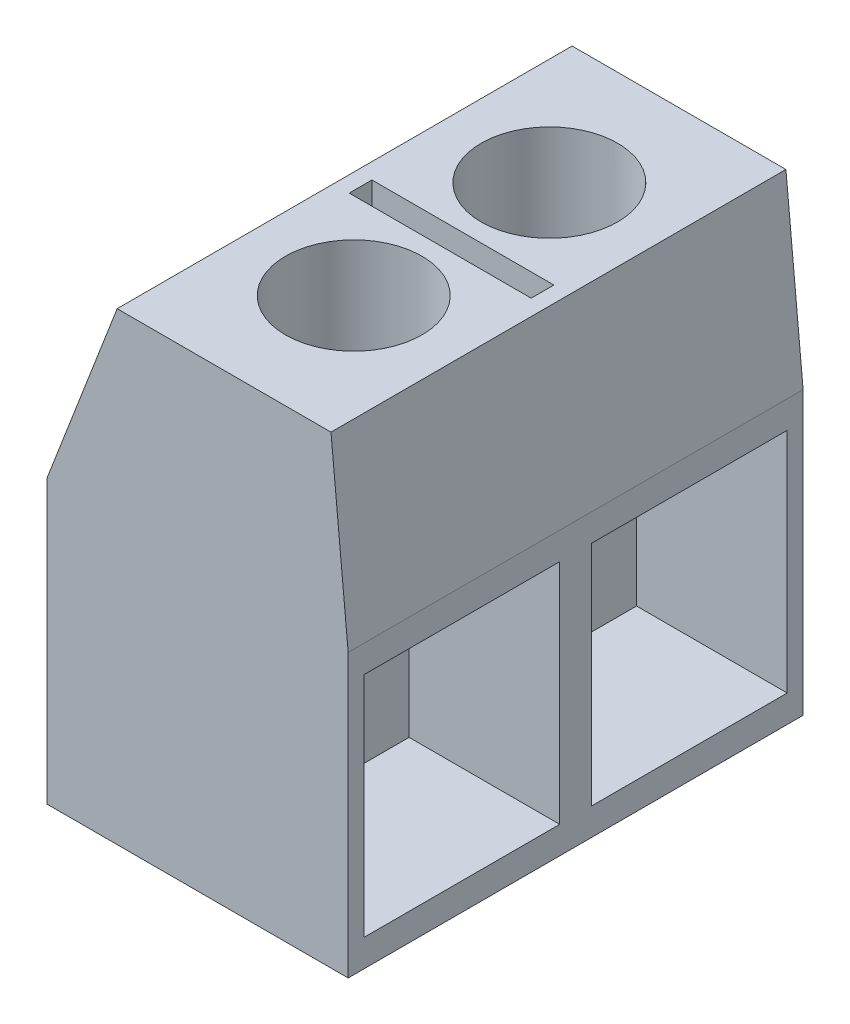
ISO-10303-21;
HEADER;
FILE_DESCRIPTION(('STEP AP214'),'2;1');
FILE_NAME('part.step','',(''),(''),'','','');
FILE_SCHEMA(('AUTOMOTIVE_DESIGN { 1 0 10303 214 1 1 1 1 }'));
ENDSEC;
DATA;
#1=APPLICATION_CONTEXT('core data for automotive mechanical design processes');
#2=APPLICATION_PROTOCOL_DEFINITION('international standard','automotive_design',2000,#1);
#3=PRODUCT_CONTEXT('',#1,'mechanical');
#4=PRODUCT('Part','Part','',(#3));
#5=PRODUCT_RELATED_PRODUCT_CATEGORY('part','',(#4));
#6=PRODUCT_DEFINITION_FORMATION('','',#4);
#7=PRODUCT_DEFINITION_CONTEXT('part definition',#1,'design');
#8=PRODUCT_DEFINITION('design','',#6,#7);
#9=PRODUCT_DEFINITION_SHAPE('','',#8);
#10=(LENGTH_UNIT() NAMED_UNIT(*) SI_UNIT(.MILLI.,.METRE.));
#11=(NAMED_UNIT(*) PLANE_ANGLE_UNIT() SI_UNIT($,.RADIAN.));
#12=(NAMED_UNIT(*) SI_UNIT($,.STERADIAN.) SOLID_ANGLE_UNIT());
#13=UNCERTAINTY_MEASURE_WITH_UNIT(LENGTH_MEASURE(1.E-05),#10,'distance_accuracy_value','');
#14=(GEOMETRIC_REPRESENTATION_CONTEXT(3) GLOBAL_UNCERTAINTY_ASSIGNED_CONTEXT((#13)) GLOBAL_UNIT_ASSIGNED_CONTEXT((#10,
#11,#12)) REPRESENTATION_CONTEXT('',''));
#15=CARTESIAN_POINT('',(0.,0.,0.));
#16=DIRECTION('',(0.,0.,1.));
#17=DIRECTION('',(1.,0.,0.));
#18=AXIS2_PLACEMENT_3D('',#15,#16,#17);
#19=CARTESIAN_POINT('',(2.93362658769155,10.2022383612236,10.));
#20=DIRECTION('',(0.,-1.,0.));
#21=DIRECTION('',(0.,0.,-1.));
#22=AXIS2_PLACEMENT_3D('',#19,#20,#21);
#23=PLANE('',#22);
#24=DIRECTION('',(0.,0.,-1.));
#25=VECTOR('',#24,1.);
#26=CARTESIAN_POINT('',(2.58362658769155,10.2022383612236,0.));
#27=LINE('',#26,#25);
#28=CARTESIAN_POINT('',(2.58362658769155,10.2022383612236,5.25));
#29=VERTEX_POINT('',#28);
#30=CARTESIAN_POINT('',(2.58362658769155,10.2022383612236,4.75));
#31=VERTEX_POINT('',#30);
#32=EDGE_CURVE('E227',#29,#31,#27,.T.);
#33=ORIENTED_EDGE('',*,*,#32,.F.);
#34=DIRECTION('',(1.,0.,0.));
#35=VECTOR('',#34,1.);
#36=CARTESIAN_POINT('',(0.,10.2022383612236,5.25));
#37=LINE('',#36,#35);
#38=CARTESIAN_POINT('',(-1.41637341230845,10.2022383612236,5.25));
#39=VERTEX_POINT('',#38);
#40=EDGE_CURVE('E55',#39,#29,#37,.T.);
#41=ORIENTED_EDGE('',*,*,#40,.F.);
#42=DIRECTION('',(0.,0.,-1.));
#43=VECTOR('',#42,1.);
#44=CARTESIAN_POINT('',(-1.41637341230845,10.2022383612236,0.));
#45=LINE('',#44,#43);
#46=CARTESIAN_POINT('',(-1.41637341230845,10.2022383612236,4.75));
#47=VERTEX_POINT('',#46);
#48=EDGE_CURVE('E211',#39,#47,#45,.T.);
#49=ORIENTED_EDGE('',*,*,#48,.T.);
#50=DIRECTION('',(1.,0.,0.));
#51=VECTOR('',#50,1.);
#52=CARTESIAN_POINT('',(0.,10.2022383612236,4.75));
#53=LINE('',#52,#51);
#54=EDGE_CURVE('E215',#47,#31,#53,.T.);
#55=ORIENTED_EDGE('',*,*,#54,.T.);
#56=EDGE_LOOP('',(#33,#41,#49,#55));
#57=FACE_BOUND('',#56,.T.);
#58=CARTESIAN_POINT('',(0.583626587691551,10.2022383612236,2.85));
#59=DIRECTION('',(0.,1.,0.));
#60=DIRECTION('',(0.,0.,1.));
#61=AXIS2_PLACEMENT_3D('',#58,#59,#60);
#62=CIRCLE('',#61,1.5);
#63=CARTESIAN_POINT('',(0.583626587691551,10.2022383612236,4.35));
#64=VERTEX_POINT('',#63);
#65=EDGE_CURVE('E244',#64,#64,#62,.T.);
#66=ORIENTED_EDGE('',*,*,#65,.F.);
#67=EDGE_LOOP('',(#66));
#68=FACE_BOUND('',#67,.T.);
#69=DIRECTION('',(-1.,0.,0.));
#70=VECTOR('',#69,1.);
#71=CARTESIAN_POINT('',(2.93362658769155,10.2022383612236,0.));
#72=LINE('',#71,#70);
#73=CARTESIAN_POINT('',(2.93362658769155,10.2022383612236,0.));
#74=VERTEX_POINT('',#73);
#75=CARTESIAN_POINT('',(-1.76637341230845,10.2022383612236,0.));
#76=VERTEX_POINT('',#75);
#77=EDGE_CURVE('E343',#74,#76,#72,.T.);
#78=ORIENTED_EDGE('',*,*,#77,.T.);
#79=DIRECTION('',(0.,0.,-1.));
#80=VECTOR('',#79,1.);
#81=CARTESIAN_POINT('',(-1.76637341230845,10.2022383612236,10.));
#82=LINE('',#81,#80);
#83=CARTESIAN_POINT('',(-1.76637341230845,10.2022383612236,10.));
#84=VERTEX_POINT('',#83);
#85=EDGE_CURVE('E365',#84,#76,#82,.T.);
#86=ORIENTED_EDGE('',*,*,#85,.F.);
#87=DIRECTION('',(-1.,0.,0.));
#88=VECTOR('',#87,1.);
#89=CARTESIAN_POINT('',(2.93362658769155,10.2022383612236,10.));
#90=LINE('',#89,#88);
#91=CARTESIAN_POINT('',(2.93362658769155,10.2022383612236,10.));
#92=VERTEX_POINT('',#91);
#93=EDGE_CURVE('E324',#92,#84,#90,.T.);
#94=ORIENTED_EDGE('',*,*,#93,.F.);
#95=DIRECTION('',(0.,0.,-1.));
#96=VECTOR('',#95,1.);
#97=CARTESIAN_POINT('',(2.93362658769155,10.2022383612236,10.));
#98=LINE('',#97,#96);
#99=EDGE_CURVE('E369',#92,#74,#98,.T.);
#100=ORIENTED_EDGE('',*,*,#99,.T.);
#101=EDGE_LOOP('',(#78,#86,#94,#100));
#102=FACE_BOUND('',#101,.T.);
#103=CARTESIAN_POINT('',(0.583626587691551,10.2022383612236,7.15));
#104=DIRECTION('',(0.,1.,0.));
#105=DIRECTION('',(0.,0.,1.));
#106=AXIS2_PLACEMENT_3D('',#103,#104,#105);
#107=CIRCLE('',#106,1.5);
#108=CARTESIAN_POINT('',(0.583626587691551,10.2022383612236,8.65));
#109=VERTEX_POINT('',#108);
#110=EDGE_CURVE('E218',#109,#109,#107,.F.);
#111=ORIENTED_EDGE('',*,*,#110,.T.);
#112=EDGE_LOOP('',(#111));
#113=FACE_BOUND('',#112,.T.);
#114=ADVANCED_FACE('F39',(#57,#68,#102,#113),#23,.F.);
#115=CARTESIAN_POINT('',(0.,0.,0.));
#116=DIRECTION('',(1.,0.,0.));
#117=DIRECTION('',(0.,0.,-1.));
#118=AXIS2_PLACEMENT_3D('',#115,#116,#117);
#119=PLANE('',#118);
#120=DIRECTION('',(0.,0.,1.));
#121=VECTOR('',#120,1.);
#122=CARTESIAN_POINT('',(0.,5.6,5.35));
#123=LINE('',#122,#121);
#124=CARTESIAN_POINT('',(0.,5.6,5.35));
#125=VERTEX_POINT('',#124);
#126=CARTESIAN_POINT('',(0.,5.6,5.76819682800352));
#127=VERTEX_POINT('',#126);
#128=EDGE_CURVE('E288',#125,#127,#123,.T.);
#129=ORIENTED_EDGE('',*,*,#128,.T.);
#130=DIRECTION('',(0.,1.,0.));
#131=VECTOR('',#130,1.);
#132=CARTESIAN_POINT('',(0.,4.90223836122364,5.76819682800352));
#133=LINE('',#132,#131);
#134=CARTESIAN_POINT('',(0.,4.90223836122364,5.76819682800352));
#135=VERTEX_POINT('',#134);
#136=EDGE_CURVE('E11',#127,#135,#133,.F.);
#137=ORIENTED_EDGE('',*,*,#136,.T.);
#138=DIRECTION('',(0.,0.,1.));
#139=VECTOR('',#138,1.);
#140=CARTESIAN_POINT('',(0.,4.90223836122364,0.));
#141=LINE('',#140,#139);
#142=CARTESIAN_POINT('',(0.,4.90223836122364,8.53180317199647));
#143=VERTEX_POINT('',#142);
#144=EDGE_CURVE('E414',#135,#143,#141,.T.);
#145=ORIENTED_EDGE('',*,*,#144,.T.);
#146=DIRECTION('',(0.,1.,0.));
#147=VECTOR('',#146,1.);
#148=CARTESIAN_POINT('',(0.,4.90223836122364,8.53180317199647));
#149=LINE('',#148,#147);
#150=CARTESIAN_POINT('',(0.,5.6,8.53180317199647));
#151=VERTEX_POINT('',#150);
#152=EDGE_CURVE('E48',#143,#151,#149,.T.);
#153=ORIENTED_EDGE('',*,*,#152,.T.);
#154=CARTESIAN_POINT('',(0.,5.6,9.65));
#155=VERTEX_POINT('',#154);
#156=EDGE_CURVE('E255',#151,#155,#123,.T.);
#157=ORIENTED_EDGE('',*,*,#156,.T.);
#158=DIRECTION('',(0.,-1.,0.));
#159=VECTOR('',#158,1.);
#160=CARTESIAN_POINT('',(0.,5.6,9.65));
#161=LINE('',#160,#159);
#162=CARTESIAN_POINT('',(0.,0.599999999999999,9.65));
#163=VERTEX_POINT('',#162);
#164=EDGE_CURVE('E292',#155,#163,#161,.T.);
#165=ORIENTED_EDGE('',*,*,#164,.T.);
#166=DIRECTION('',(0.,0.,-1.));
#167=VECTOR('',#166,1.);
#168=CARTESIAN_POINT('',(0.,0.599999999999999,5.35));
#169=LINE('',#168,#167);
#170=CARTESIAN_POINT('',(0.,0.599999999999999,5.35));
#171=VERTEX_POINT('',#170);
#172=EDGE_CURVE('E296',#163,#171,#169,.T.);
#173=ORIENTED_EDGE('',*,*,#172,.T.);
#174=DIRECTION('',(0.,1.,0.));
#175=VECTOR('',#174,1.);
#176=CARTESIAN_POINT('',(0.,5.6,5.35));
#177=LINE('',#176,#175);
#178=EDGE_CURVE('E300',#171,#125,#177,.T.);
#179=ORIENTED_EDGE('',*,*,#178,.T.);
#180=EDGE_LOOP('',(#129,#137,#145,#153,#157,#165,#173,#179));
#181=FACE_BOUND('',#180,.T.);
#182=ADVANCED_FACE('F421',(#181),#119,.T.);
#183=CARTESIAN_POINT('',(3.31110254712462,0.,10.));
#184=DIRECTION('',(-1.,0.,0.));
#185=DIRECTION('',(0.,0.,1.));
#186=AXIS2_PLACEMENT_3D('',#183,#184,#185);
#187=PLANE('',#186);
#188=DIRECTION('',(0.,0.,1.));
#189=VECTOR('',#188,1.);
#190=CARTESIAN_POINT('',(3.31110254712462,5.6,10.));
#191=LINE('',#190,#189);
#192=CARTESIAN_POINT('',(3.31110254712462,5.6,5.35));
#193=VERTEX_POINT('',#192);
#194=CARTESIAN_POINT('',(3.31110254712462,5.6,9.65));
#195=VERTEX_POINT('',#194);
#196=EDGE_CURVE('E387',#193,#195,#191,.T.);
#197=ORIENTED_EDGE('',*,*,#196,.F.);
#198=DIRECTION('',(0.,1.,0.));
#199=VECTOR('',#198,1.);
#200=CARTESIAN_POINT('',(3.31110254712462,0.,5.35));
#201=LINE('',#200,#199);
#202=CARTESIAN_POINT('',(3.31110254712462,0.599999999999999,5.35));
#203=VERTEX_POINT('',#202);
#204=EDGE_CURVE('E377',#203,#193,#201,.T.);
#205=ORIENTED_EDGE('',*,*,#204,.F.);
#206=DIRECTION('',(0.,0.,-1.));
#207=VECTOR('',#206,1.);
#208=CARTESIAN_POINT('',(3.31110254712462,0.599999999999999,10.));
#209=LINE('',#208,#207);
#210=CARTESIAN_POINT('',(3.31110254712462,0.599999999999999,9.65));
#211=VERTEX_POINT('',#210);
#212=EDGE_CURVE('E380',#211,#203,#209,.T.);
#213=ORIENTED_EDGE('',*,*,#212,.F.);
#214=DIRECTION('',(0.,-1.,0.));
#215=VECTOR('',#214,1.);
#216=CARTESIAN_POINT('',(3.31110254712462,0.,9.65));
#217=LINE('',#216,#215);
#218=EDGE_CURVE('E384',#195,#211,#217,.T.);
#219=ORIENTED_EDGE('',*,*,#218,.F.);
#220=EDGE_LOOP('',(#197,#205,#213,#219));
#221=FACE_BOUND('',#220,.T.);
#222=DIRECTION('',(0.,1.,0.));
#223=VECTOR('',#222,1.);
#224=CARTESIAN_POINT('',(3.31110254712462,0.,0.));
#225=LINE('',#224,#223);
#226=CARTESIAN_POINT('',(3.31110254712462,0.,0.));
#227=VERTEX_POINT('',#226);
#228=CARTESIAN_POINT('',(3.31110254712462,6.2,0.));
#229=VERTEX_POINT('',#228);
#230=EDGE_CURVE('E287',#227,#229,#225,.T.);
#231=ORIENTED_EDGE('',*,*,#230,.T.);
#232=DIRECTION('',(0.,0.,-1.));
#233=VECTOR('',#232,1.);
#234=CARTESIAN_POINT('',(3.31110254712462,6.2,10.));
#235=LINE('',#234,#233);
#236=CARTESIAN_POINT('',(3.31110254712462,6.2,10.));
#237=VERTEX_POINT('',#236);
#238=EDGE_CURVE('E373',#237,#229,#235,.T.);
#239=ORIENTED_EDGE('',*,*,#238,.F.);
#240=DIRECTION('',(0.,1.,0.));
#241=VECTOR('',#240,1.);
#242=CARTESIAN_POINT('',(3.31110254712462,0.,10.));
#243=LINE('',#242,#241);
#244=CARTESIAN_POINT('',(3.31110254712462,0.,10.));
#245=VERTEX_POINT('',#244);
#246=EDGE_CURVE('E316',#245,#237,#243,.T.);
#247=ORIENTED_EDGE('',*,*,#246,.F.);
#248=DIRECTION('',(0.,0.,-1.));
#249=VECTOR('',#248,1.);
#250=CARTESIAN_POINT('',(3.31110254712462,0.,10.));
#251=LINE('',#250,#249);
#252=EDGE_CURVE('E336',#245,#227,#251,.T.);
#253=ORIENTED_EDGE('',*,*,#252,.T.);
#254=EDGE_LOOP('',(#231,#239,#247,#253));
#255=FACE_BOUND('',#254,.T.);
#256=DIRECTION('',(0.,1.,0.));
#257=VECTOR('',#256,1.);
#258=CARTESIAN_POINT('',(3.31110254712462,0.,0.350000000000001));
#259=LINE('',#258,#257);
#260=CARTESIAN_POINT('',(3.31110254712462,0.599999999999999,0.35));
#261=VERTEX_POINT('',#260);
#262=CARTESIAN_POINT('',(3.31110254712462,5.6,0.35));
#263=VERTEX_POINT('',#262);
#264=EDGE_CURVE('E400',#261,#263,#259,.T.);
#265=ORIENTED_EDGE('',*,*,#264,.F.);
#266=DIRECTION('',(0.,0.,-1.));
#267=VECTOR('',#266,1.);
#268=CARTESIAN_POINT('',(3.31110254712462,0.599999999999999,10.));
#269=LINE('',#268,#267);
#270=CARTESIAN_POINT('',(3.31110254712462,0.599999999999999,4.65));
#271=VERTEX_POINT('',#270);
#272=EDGE_CURVE('E390',#271,#261,#269,.T.);
#273=ORIENTED_EDGE('',*,*,#272,.F.);
#274=DIRECTION('',(0.,-1.,0.));
#275=VECTOR('',#274,1.);
#276=CARTESIAN_POINT('',(3.31110254712462,0.,4.65));
#277=LINE('',#276,#275);
#278=CARTESIAN_POINT('',(3.31110254712462,5.6,4.65));
#279=VERTEX_POINT('',#278);
#280=EDGE_CURVE('E393',#279,#271,#277,.T.);
#281=ORIENTED_EDGE('',*,*,#280,.F.);
#282=DIRECTION('',(0.,0.,1.));
#283=VECTOR('',#282,1.);
#284=CARTESIAN_POINT('',(3.31110254712462,5.6,10.));
#285=LINE('',#284,#283);
#286=EDGE_CURVE('E397',#263,#279,#285,.T.);
#287=ORIENTED_EDGE('',*,*,#286,.F.);
#288=EDGE_LOOP('',(#265,#273,#281,#287));
#289=FACE_BOUND('',#288,.T.);
#290=ADVANCED_FACE('F41',(#221,#255,#289),#187,.F.);
#291=CARTESIAN_POINT('',(3.31110254712462,6.2,10.));
#292=DIRECTION('',(-0.995581681896428,-0.093899492396285,0.));
#293=DIRECTION('',(0.093899492396285,-0.995581681896428,0.));
#294=AXIS2_PLACEMENT_3D('',#291,#292,#293);
#295=PLANE('',#294);
#296=DIRECTION('',(-0.093899492396285,0.995581681896428,0.));
#297=VECTOR('',#296,1.);
#298=CARTESIAN_POINT('',(3.31110254712462,6.2,0.));
#299=LINE('',#298,#297);
#300=EDGE_CURVE('E340',#229,#74,#299,.T.);
#301=ORIENTED_EDGE('',*,*,#300,.T.);
#302=ORIENTED_EDGE('',*,*,#99,.F.);
#303=DIRECTION('',(-0.093899492396285,0.995581681896428,0.));
#304=VECTOR('',#303,1.);
#305=CARTESIAN_POINT('',(3.31110254712462,6.2,10.));
#306=LINE('',#305,#304);
#307=EDGE_CURVE('E320',#237,#92,#306,.T.);
#308=ORIENTED_EDGE('',*,*,#307,.F.);
#309=ORIENTED_EDGE('',*,*,#238,.T.);
#310=EDGE_LOOP('',(#301,#302,#308,#309));
#311=FACE_BOUND('',#310,.T.);
#312=ADVANCED_FACE('F460',(#311),#295,.F.);
#313=CARTESIAN_POINT('',(-1.76637341230845,10.2022383612236,10.));
#314=DIRECTION('',(0.932922694923926,-0.36007672140237,0.));
#315=DIRECTION('',(0.36007672140237,0.932922694923926,0.));
#316=AXIS2_PLACEMENT_3D('',#313,#314,#315);
#317=PLANE('',#316);
#318=DIRECTION('',(-0.36007672140237,-0.932922694923926,0.));
#319=VECTOR('',#318,1.);
#320=CARTESIAN_POINT('',(-1.76637341230845,10.2022383612236,0.));
#321=LINE('',#320,#319);
#322=CARTESIAN_POINT('',(-3.31110254712462,6.2,0.));
#323=VERTEX_POINT('',#322);
#324=EDGE_CURVE('E346',#76,#323,#321,.T.);
#325=ORIENTED_EDGE('',*,*,#324,.T.);
#326=DIRECTION('',(0.,0.,-1.));
#327=VECTOR('',#326,1.);
#328=CARTESIAN_POINT('',(-3.31110254712462,6.2,10.));
#329=LINE('',#328,#327);
#330=CARTESIAN_POINT('',(-3.31110254712462,6.2,10.));
#331=VERTEX_POINT('',#330);
#332=EDGE_CURVE('E361',#331,#323,#329,.T.);
#333=ORIENTED_EDGE('',*,*,#332,.F.);
#334=DIRECTION('',(-0.36007672140237,-0.932922694923926,0.));
#335=VECTOR('',#334,1.);
#336=CARTESIAN_POINT('',(-1.76637341230845,10.2022383612236,10.));
#337=LINE('',#336,#335);
#338=EDGE_CURVE('E327',#84,#331,#337,.T.);
#339=ORIENTED_EDGE('',*,*,#338,.F.);
#340=ORIENTED_EDGE('',*,*,#85,.T.);
#341=EDGE_LOOP('',(#325,#333,#339,#340));
#342=FACE_BOUND('',#341,.T.);
#343=ADVANCED_FACE('F458',(#342),#317,.F.);
#344=CARTESIAN_POINT('',(-3.31110254712462,6.2,10.));
#345=DIRECTION('',(1.,0.,0.));
#346=DIRECTION('',(0.,0.,-1.));
#347=AXIS2_PLACEMENT_3D('',#344,#345,#346);
#348=PLANE('',#347);
#349=DIRECTION('',(0.,-1.,0.));
#350=VECTOR('',#349,1.);
#351=CARTESIAN_POINT('',(-3.31110254712462,6.2,0.));
#352=LINE('',#351,#350);
#353=CARTESIAN_POINT('',(-3.31110254712462,0.,0.));
#354=VERTEX_POINT('',#353);
#355=EDGE_CURVE('E349',#323,#354,#352,.T.);
#356=ORIENTED_EDGE('',*,*,#355,.T.);
#357=DIRECTION('',(0.,0.,-1.));
#358=VECTOR('',#357,1.);
#359=CARTESIAN_POINT('',(-3.31110254712462,0.,10.));
#360=LINE('',#359,#358);
#361=CARTESIAN_POINT('',(-3.31110254712462,0.,10.));
#362=VERTEX_POINT('',#361);
#363=EDGE_CURVE('E357',#362,#354,#360,.T.);
#364=ORIENTED_EDGE('',*,*,#363,.F.);
#365=DIRECTION('',(0.,-1.,0.));
#366=VECTOR('',#365,1.);
#367=CARTESIAN_POINT('',(-3.31110254712462,6.2,10.));
#368=LINE('',#367,#366);
#369=EDGE_CURVE('E330',#331,#362,#368,.T.);
#370=ORIENTED_EDGE('',*,*,#369,.F.);
#371=ORIENTED_EDGE('',*,*,#332,.T.);
#372=EDGE_LOOP('',(#356,#364,#370,#371));
#373=FACE_BOUND('',#372,.T.);
#374=ADVANCED_FACE('F467',(#373),#348,.F.);
#375=CARTESIAN_POINT('',(-3.31110254712462,0.,10.));
#376=DIRECTION('',(0.,1.,0.));
#377=DIRECTION('',(0.,0.,1.));
#378=AXIS2_PLACEMENT_3D('',#375,#376,#377);
#379=PLANE('',#378);
#380=DIRECTION('',(1.,0.,0.));
#381=VECTOR('',#380,1.);
#382=CARTESIAN_POINT('',(-3.31110254712462,0.,0.));
#383=LINE('',#382,#381);
#384=EDGE_CURVE('E321',#354,#227,#383,.T.);
#385=ORIENTED_EDGE('',*,*,#384,.T.);
#386=ORIENTED_EDGE('',*,*,#252,.F.);
#387=DIRECTION('',(1.,0.,0.));
#388=VECTOR('',#387,1.);
#389=CARTESIAN_POINT('',(-3.31110254712462,0.,10.));
#390=LINE('',#389,#388);
#391=EDGE_CURVE('E333',#362,#245,#390,.T.);
#392=ORIENTED_EDGE('',*,*,#391,.F.);
#393=ORIENTED_EDGE('',*,*,#363,.T.);
#394=EDGE_LOOP('',(#385,#386,#392,#393));
#395=FACE_BOUND('',#394,.T.);
#396=ADVANCED_FACE('F495',(#395),#379,.F.);
#397=CARTESIAN_POINT('',(0.,0.,10.));
#398=DIRECTION('',(0.,0.,1.));
#399=DIRECTION('',(1.,0.,0.));
#400=AXIS2_PLACEMENT_3D('',#397,#398,#399);
#401=PLANE('',#400);
#402=ORIENTED_EDGE('',*,*,#246,.T.);
#403=ORIENTED_EDGE('',*,*,#307,.T.);
#404=ORIENTED_EDGE('',*,*,#93,.T.);
#405=ORIENTED_EDGE('',*,*,#338,.T.);
#406=ORIENTED_EDGE('',*,*,#369,.T.);
#407=ORIENTED_EDGE('',*,*,#391,.T.);
#408=EDGE_LOOP('',(#402,#403,#404,#405,#406,#407));
#409=FACE_BOUND('',#408,.T.);
#410=ADVANCED_FACE('F489',(#409),#401,.T.);
#411=CARTESIAN_POINT('',(0.,0.,0.));
#412=DIRECTION('',(0.,0.,1.));
#413=DIRECTION('',(1.,0.,0.));
#414=AXIS2_PLACEMENT_3D('',#411,#412,#413);
#415=PLANE('',#414);
#416=ORIENTED_EDGE('',*,*,#230,.F.);
#417=ORIENTED_EDGE('',*,*,#384,.F.);
#418=ORIENTED_EDGE('',*,*,#355,.F.);
#419=ORIENTED_EDGE('',*,*,#324,.F.);
#420=ORIENTED_EDGE('',*,*,#77,.F.);
#421=ORIENTED_EDGE('',*,*,#300,.F.);
#422=EDGE_LOOP('',(#416,#417,#418,#419,#420,#421));
#423=FACE_BOUND('',#422,.T.);
#424=ADVANCED_FACE('F479',(#423),#415,.F.);
#425=CARTESIAN_POINT('',(4.3,5.6,5.35));
#426=DIRECTION('',(0.,-1.,0.));
#427=DIRECTION('',(0.,0.,-1.));
#428=AXIS2_PLACEMENT_3D('',#425,#426,#427);
#429=PLANE('',#428);
#430=ORIENTED_EDGE('',*,*,#156,.F.);
#431=CARTESIAN_POINT('',(0.583626587691551,5.6,7.15));
#432=DIRECTION('',(0.,-1.,0.));
#433=DIRECTION('',(0.,0.,-1.));
#434=AXIS2_PLACEMENT_3D('',#431,#432,#433);
#435=CIRCLE('',#434,1.5);
#436=EDGE_CURVE('E251',#151,#127,#435,.F.);
#437=ORIENTED_EDGE('',*,*,#436,.T.);
#438=ORIENTED_EDGE('',*,*,#128,.F.);
#439=DIRECTION('',(-1.,0.,0.));
#440=VECTOR('',#439,1.);
#441=CARTESIAN_POINT('',(4.3,5.6,5.35));
#442=LINE('',#441,#440);
#443=EDGE_CURVE('E304',#193,#125,#442,.T.);
#444=ORIENTED_EDGE('',*,*,#443,.F.);
#445=ORIENTED_EDGE('',*,*,#196,.T.);
#446=DIRECTION('',(-1.,0.,0.));
#447=VECTOR('',#446,1.);
#448=CARTESIAN_POINT('',(4.3,5.6,9.65));
#449=LINE('',#448,#447);
#450=EDGE_CURVE('E261',#195,#155,#449,.T.);
#451=ORIENTED_EDGE('',*,*,#450,.T.);
#452=EDGE_LOOP('',(#430,#437,#438,#444,#445,#451));
#453=FACE_BOUND('',#452,.T.);
#454=ADVANCED_FACE('F424',(#453),#429,.T.);
#455=CARTESIAN_POINT('',(4.3,5.6,9.65));
#456=DIRECTION('',(0.,0.,-1.));
#457=DIRECTION('',(0.,1.,0.));
#458=AXIS2_PLACEMENT_3D('',#455,#456,#457);
#459=PLANE('',#458);
#460=ORIENTED_EDGE('',*,*,#218,.T.);
#461=DIRECTION('',(-1.,0.,0.));
#462=VECTOR('',#461,1.);
#463=CARTESIAN_POINT('',(4.3,0.599999999999999,9.65));
#464=LINE('',#463,#462);
#465=EDGE_CURVE('E310',#211,#163,#464,.T.);
#466=ORIENTED_EDGE('',*,*,#465,.T.);
#467=ORIENTED_EDGE('',*,*,#164,.F.);
#468=ORIENTED_EDGE('',*,*,#450,.F.);
#469=EDGE_LOOP('',(#460,#466,#467,#468));
#470=FACE_BOUND('',#469,.T.);
#471=ADVANCED_FACE('F508',(#470),#459,.T.);
#472=CARTESIAN_POINT('',(4.3,0.599999999999999,5.35));
#473=DIRECTION('',(0.,1.,0.));
#474=DIRECTION('',(0.,0.,1.));
#475=AXIS2_PLACEMENT_3D('',#472,#473,#474);
#476=PLANE('',#475);
#477=ORIENTED_EDGE('',*,*,#212,.T.);
#478=DIRECTION('',(-1.,0.,0.));
#479=VECTOR('',#478,1.);
#480=CARTESIAN_POINT('',(4.3,0.599999999999999,5.35));
#481=LINE('',#480,#479);
#482=EDGE_CURVE('E307',#203,#171,#481,.T.);
#483=ORIENTED_EDGE('',*,*,#482,.T.);
#484=ORIENTED_EDGE('',*,*,#172,.F.);
#485=ORIENTED_EDGE('',*,*,#465,.F.);
#486=EDGE_LOOP('',(#477,#483,#484,#485));
#487=FACE_BOUND('',#486,.T.);
#488=ADVANCED_FACE('F511',(#487),#476,.T.);
#489=CARTESIAN_POINT('',(4.3,5.6,5.35));
#490=DIRECTION('',(0.,0.,1.));
#491=DIRECTION('',(0.,-1.,0.));
#492=AXIS2_PLACEMENT_3D('',#489,#490,#491);
#493=PLANE('',#492);
#494=ORIENTED_EDGE('',*,*,#204,.T.);
#495=ORIENTED_EDGE('',*,*,#443,.T.);
#496=ORIENTED_EDGE('',*,*,#178,.F.);
#497=ORIENTED_EDGE('',*,*,#482,.F.);
#498=EDGE_LOOP('',(#494,#495,#496,#497));
#499=FACE_BOUND('',#498,.T.);
#500=ADVANCED_FACE('F515',(#499),#493,.T.);
#501=CARTESIAN_POINT('',(4.3,5.6,0.35));
#502=DIRECTION('',(0.,0.,1.));
#503=DIRECTION('',(0.,-1.,0.));
#504=AXIS2_PLACEMENT_3D('',#501,#502,#503);
#505=PLANE('',#504);
#506=ORIENTED_EDGE('',*,*,#264,.T.);
#507=DIRECTION('',(-1.,0.,0.));
#508=VECTOR('',#507,1.);
#509=CARTESIAN_POINT('',(4.3,5.6,0.35));
#510=LINE('',#509,#508);
#511=CARTESIAN_POINT('',(0.,5.6,0.35));
#512=VERTEX_POINT('',#511);
#513=EDGE_CURVE('E284',#263,#512,#510,.T.);
#514=ORIENTED_EDGE('',*,*,#513,.T.);
#515=DIRECTION('',(0.,1.,0.));
#516=VECTOR('',#515,1.);
#517=CARTESIAN_POINT('',(0.,5.6,0.35));
#518=LINE('',#517,#516);
#519=CARTESIAN_POINT('',(0.,0.599999999999999,0.35));
#520=VERTEX_POINT('',#519);
#521=EDGE_CURVE('E256',#520,#512,#518,.T.);
#522=ORIENTED_EDGE('',*,*,#521,.F.);
#523=DIRECTION('',(-1.,0.,0.));
#524=VECTOR('',#523,1.);
#525=CARTESIAN_POINT('',(4.3,0.599999999999999,0.35));
#526=LINE('',#525,#524);
#527=EDGE_CURVE('E274',#261,#520,#526,.T.);
#528=ORIENTED_EDGE('',*,*,#527,.F.);
#529=EDGE_LOOP('',(#506,#514,#522,#528));
#530=FACE_BOUND('',#529,.T.);
#531=ADVANCED_FACE('F518',(#530),#505,.T.);
#532=CARTESIAN_POINT('',(4.3,5.6,4.65));
#533=DIRECTION('',(0.,-1.,0.));
#534=DIRECTION('',(0.,0.,-1.));
#535=AXIS2_PLACEMENT_3D('',#532,#533,#534);
#536=PLANE('',#535);
#537=CARTESIAN_POINT('',(0.583626587691551,5.6,2.85));
#538=DIRECTION('',(0.,-1.,0.));
#539=DIRECTION('',(0.,0.,-1.));
#540=AXIS2_PLACEMENT_3D('',#537,#538,#539);
#541=CIRCLE('',#540,1.5);
#542=CARTESIAN_POINT('',(0.,5.6,1.46819682800353));
#543=VERTEX_POINT('',#542);
#544=CARTESIAN_POINT('',(0.,5.6,4.23180317199647));
#545=VERTEX_POINT('',#544);
#546=EDGE_CURVE('E248',#543,#545,#541,.T.);
#547=ORIENTED_EDGE('',*,*,#546,.F.);
#548=DIRECTION('',(0.,0.,1.));
#549=VECTOR('',#548,1.);
#550=CARTESIAN_POINT('',(0.,5.6,4.65));
#551=LINE('',#550,#549);
#552=EDGE_CURVE('E262',#512,#543,#551,.T.);
#553=ORIENTED_EDGE('',*,*,#552,.F.);
#554=ORIENTED_EDGE('',*,*,#513,.F.);
#555=ORIENTED_EDGE('',*,*,#286,.T.);
#556=DIRECTION('',(-1.,0.,0.));
#557=VECTOR('',#556,1.);
#558=CARTESIAN_POINT('',(4.3,5.6,4.65));
#559=LINE('',#558,#557);
#560=CARTESIAN_POINT('',(0.,5.6,4.65));
#561=VERTEX_POINT('',#560);
#562=EDGE_CURVE('E280',#279,#561,#559,.T.);
#563=ORIENTED_EDGE('',*,*,#562,.T.);
#564=EDGE_CURVE('E260',#545,#561,#551,.T.);
#565=ORIENTED_EDGE('',*,*,#564,.F.);
#566=EDGE_LOOP('',(#547,#553,#554,#555,#563,#565));
#567=FACE_BOUND('',#566,.T.);
#568=ADVANCED_FACE('F523',(#567),#536,.T.);
#569=CARTESIAN_POINT('',(4.3,5.6,4.65));
#570=DIRECTION('',(0.,0.,-1.));
#571=DIRECTION('',(0.,1.,0.));
#572=AXIS2_PLACEMENT_3D('',#569,#570,#571);
#573=PLANE('',#572);
#574=ORIENTED_EDGE('',*,*,#280,.T.);
#575=DIRECTION('',(-1.,0.,0.));
#576=VECTOR('',#575,1.);
#577=CARTESIAN_POINT('',(4.3,0.599999999999999,4.65));
#578=LINE('',#577,#576);
#579=CARTESIAN_POINT('',(0.,0.599999999999999,4.65));
#580=VERTEX_POINT('',#579);
#581=EDGE_CURVE('E277',#271,#580,#578,.T.);
#582=ORIENTED_EDGE('',*,*,#581,.T.);
#583=DIRECTION('',(0.,-1.,0.));
#584=VECTOR('',#583,1.);
#585=CARTESIAN_POINT('',(0.,5.6,4.65));
#586=LINE('',#585,#584);
#587=EDGE_CURVE('E266',#561,#580,#586,.T.);
#588=ORIENTED_EDGE('',*,*,#587,.F.);
#589=ORIENTED_EDGE('',*,*,#562,.F.);
#590=EDGE_LOOP('',(#574,#582,#588,#589));
#591=FACE_BOUND('',#590,.T.);
#592=ADVANCED_FACE('F527',(#591),#573,.T.);
#593=CARTESIAN_POINT('',(4.3,0.599999999999999,4.65));
#594=DIRECTION('',(0.,1.,0.));
#595=DIRECTION('',(0.,0.,1.));
#596=AXIS2_PLACEMENT_3D('',#593,#594,#595);
#597=PLANE('',#596);
#598=ORIENTED_EDGE('',*,*,#272,.T.);
#599=ORIENTED_EDGE('',*,*,#527,.T.);
#600=DIRECTION('',(0.,0.,-1.));
#601=VECTOR('',#600,1.);
#602=CARTESIAN_POINT('',(0.,0.599999999999999,4.65));
#603=LINE('',#602,#601);
#604=EDGE_CURVE('E270',#580,#520,#603,.T.);
#605=ORIENTED_EDGE('',*,*,#604,.F.);
#606=ORIENTED_EDGE('',*,*,#581,.F.);
#607=EDGE_LOOP('',(#598,#599,#605,#606));
#608=FACE_BOUND('',#607,.T.);
#609=ADVANCED_FACE('F531',(#608),#597,.T.);
#610=CARTESIAN_POINT('',(0.,0.,0.));
#611=DIRECTION('',(1.,0.,0.));
#612=DIRECTION('',(0.,0.,-1.));
#613=AXIS2_PLACEMENT_3D('',#610,#611,#612);
#614=PLANE('',#613);
#615=DIRECTION('',(0.,1.,0.));
#616=VECTOR('',#615,1.);
#617=CARTESIAN_POINT('',(0.,4.90223836122364,1.46819682800353));
#618=LINE('',#617,#616);
#619=CARTESIAN_POINT('',(0.,4.90223836122364,1.46819682800353));
#620=VERTEX_POINT('',#619);
#621=EDGE_CURVE('E411',#620,#543,#618,.T.);
#622=ORIENTED_EDGE('',*,*,#621,.F.);
#623=DIRECTION('',(0.,0.,1.));
#624=VECTOR('',#623,1.);
#625=CARTESIAN_POINT('',(0.,4.90223836122364,0.));
#626=LINE('',#625,#624);
#627=CARTESIAN_POINT('',(0.,4.90223836122364,4.23180317199647));
#628=VERTEX_POINT('',#627);
#629=EDGE_CURVE('E403',#620,#628,#626,.T.);
#630=ORIENTED_EDGE('',*,*,#629,.T.);
#631=DIRECTION('',(0.,1.,0.));
#632=VECTOR('',#631,1.);
#633=CARTESIAN_POINT('',(0.,4.90223836122364,4.23180317199647));
#634=LINE('',#633,#632);
#635=EDGE_CURVE('E407',#545,#628,#634,.F.);
#636=ORIENTED_EDGE('',*,*,#635,.F.);
#637=ORIENTED_EDGE('',*,*,#564,.T.);
#638=ORIENTED_EDGE('',*,*,#587,.T.);
#639=ORIENTED_EDGE('',*,*,#604,.T.);
#640=ORIENTED_EDGE('',*,*,#521,.T.);
#641=ORIENTED_EDGE('',*,*,#552,.T.);
#642=EDGE_LOOP('',(#622,#630,#636,#637,#638,#639,#640,#641));
#643=FACE_BOUND('',#642,.T.);
#644=ADVANCED_FACE('F535',(#643),#614,.T.);
#645=CARTESIAN_POINT('',(0.583626587691551,4.90223836122364,2.85));
#646=DIRECTION('',(0.,1.,0.));
#647=DIRECTION('',(0.,0.,1.));
#648=AXIS2_PLACEMENT_3D('',#645,#646,#647);
#649=CYLINDRICAL_SURFACE('',#648,1.5);
#650=ORIENTED_EDGE('',*,*,#621,.T.);
#651=ORIENTED_EDGE('',*,*,#546,.T.);
#652=ORIENTED_EDGE('',*,*,#635,.T.);
#653=CARTESIAN_POINT('',(0.583626587691551,4.90223836122364,2.85));
#654=DIRECTION('',(0.,1.,0.));
#655=DIRECTION('',(0.,0.,1.));
#656=AXIS2_PLACEMENT_3D('',#653,#654,#655);
#657=CIRCLE('',#656,1.5);
#658=EDGE_CURVE('E228',#620,#628,#657,.T.);
#659=ORIENTED_EDGE('',*,*,#658,.F.);
#660=EDGE_LOOP('',(#650,#651,#652,#659));
#661=FACE_BOUND('',#660,.T.);
#662=ORIENTED_EDGE('',*,*,#65,.T.);
#663=EDGE_LOOP('',(#662));
#664=FACE_BOUND('',#663,.T.);
#665=ADVANCED_FACE('F445',(#661,#664),#649,.F.);
#666=CARTESIAN_POINT('',(0.,4.90223836122364,0.));
#667=DIRECTION('',(0.,1.,0.));
#668=DIRECTION('',(0.,0.,1.));
#669=AXIS2_PLACEMENT_3D('',#666,#667,#668);
#670=PLANE('',#669);
#671=ORIENTED_EDGE('',*,*,#658,.T.);
#672=ORIENTED_EDGE('',*,*,#629,.F.);
#673=EDGE_LOOP('',(#671,#672));
#674=FACE_BOUND('',#673,.T.);
#675=ADVANCED_FACE('F438',(#674),#670,.T.);
#676=CARTESIAN_POINT('',(0.583626587691551,4.90223836122364,7.15));
#677=DIRECTION('',(0.,1.,0.));
#678=DIRECTION('',(0.,0.,1.));
#679=AXIS2_PLACEMENT_3D('',#676,#677,#678);
#680=CYLINDRICAL_SURFACE('',#679,1.5);
#681=ORIENTED_EDGE('',*,*,#436,.F.);
#682=ORIENTED_EDGE('',*,*,#152,.F.);
#683=CARTESIAN_POINT('',(0.583626587691551,4.90223836122364,7.15));
#684=DIRECTION('',(0.,1.,0.));
#685=DIRECTION('',(0.,0.,1.));
#686=AXIS2_PLACEMENT_3D('',#683,#684,#685);
#687=CIRCLE('',#686,1.5);
#688=EDGE_CURVE('E62',#143,#135,#687,.F.);
#689=ORIENTED_EDGE('',*,*,#688,.T.);
#690=ORIENTED_EDGE('',*,*,#136,.F.);
#691=EDGE_LOOP('',(#681,#682,#689,#690));
#692=FACE_BOUND('',#691,.T.);
#693=ORIENTED_EDGE('',*,*,#110,.F.);
#694=EDGE_LOOP('',(#693));
#695=FACE_BOUND('',#694,.T.);
#696=ADVANCED_FACE('F435',(#692,#695),#680,.F.);
#697=CARTESIAN_POINT('',(0.,4.90223836122364,0.));
#698=DIRECTION('',(0.,1.,0.));
#699=DIRECTION('',(0.,0.,1.));
#700=AXIS2_PLACEMENT_3D('',#697,#698,#699);
#701=PLANE('',#700);
#702=ORIENTED_EDGE('',*,*,#688,.F.);
#703=ORIENTED_EDGE('',*,*,#144,.F.);
#704=EDGE_LOOP('',(#702,#703));
#705=FACE_BOUND('',#704,.T.);
#706=ADVANCED_FACE('F437',(#705),#701,.T.);
#707=CARTESIAN_POINT('',(0.,4.90223836122364,5.25));
#708=DIRECTION('',(0.,0.,1.));
#709=DIRECTION('',(1.,0.,0.));
#710=AXIS2_PLACEMENT_3D('',#707,#708,#709);
#711=PLANE('',#710);
#712=ORIENTED_EDGE('',*,*,#40,.T.);
#713=DIRECTION('',(0.,1.,0.));
#714=VECTOR('',#713,1.);
#715=CARTESIAN_POINT('',(2.58362658769155,4.90223836122364,5.25));
#716=LINE('',#715,#714);
#717=CARTESIAN_POINT('',(2.58362658769155,4.90223836122364,5.25));
#718=VERTEX_POINT('',#717);
#719=EDGE_CURVE('E187',#718,#29,#716,.T.);
#720=ORIENTED_EDGE('',*,*,#719,.F.);
#721=DIRECTION('',(1.,0.,0.));
#722=VECTOR('',#721,1.);
#723=CARTESIAN_POINT('',(0.,4.90223836122364,5.25));
#724=LINE('',#723,#722);
#725=CARTESIAN_POINT('',(-1.41637341230845,4.90223836122364,5.25));
#726=VERTEX_POINT('',#725);
#727=EDGE_CURVE('E191',#726,#718,#724,.T.);
#728=ORIENTED_EDGE('',*,*,#727,.F.);
#729=DIRECTION('',(0.,1.,0.));
#730=VECTOR('',#729,1.);
#731=CARTESIAN_POINT('',(-1.41637341230845,4.90223836122364,5.25));
#732=LINE('',#731,#730);
#733=EDGE_CURVE('E234',#726,#39,#732,.T.);
#734=ORIENTED_EDGE('',*,*,#733,.T.);
#735=EDGE_LOOP('',(#712,#720,#728,#734));
#736=FACE_BOUND('',#735,.T.);
#737=ADVANCED_FACE('F189',(#736),#711,.F.);
#738=CARTESIAN_POINT('',(-1.41637341230845,4.90223836122364,0.));
#739=DIRECTION('',(1.,0.,0.));
#740=DIRECTION('',(0.,0.,-1.));
#741=AXIS2_PLACEMENT_3D('',#738,#739,#740);
#742=PLANE('',#741);
#743=ORIENTED_EDGE('',*,*,#48,.F.);
#744=ORIENTED_EDGE('',*,*,#733,.F.);
#745=DIRECTION('',(0.,0.,-1.));
#746=VECTOR('',#745,1.);
#747=CARTESIAN_POINT('',(-1.41637341230845,4.90223836122364,0.));
#748=LINE('',#747,#746);
#749=CARTESIAN_POINT('',(-1.41637341230845,4.90223836122364,4.75));
#750=VERTEX_POINT('',#749);
#751=EDGE_CURVE('E197',#726,#750,#748,.T.);
#752=ORIENTED_EDGE('',*,*,#751,.T.);
#753=DIRECTION('',(0.,1.,0.));
#754=VECTOR('',#753,1.);
#755=CARTESIAN_POINT('',(-1.41637341230845,4.90223836122364,4.75));
#756=LINE('',#755,#754);
#757=EDGE_CURVE('E237',#750,#47,#756,.T.);
#758=ORIENTED_EDGE('',*,*,#757,.T.);
#759=EDGE_LOOP('',(#743,#744,#752,#758));
#760=FACE_BOUND('',#759,.T.);
#761=ADVANCED_FACE('F545',(#760),#742,.T.);
#762=CARTESIAN_POINT('',(0.,4.90223836122364,4.75));
#763=DIRECTION('',(0.,0.,1.));
#764=DIRECTION('',(1.,0.,0.));
#765=AXIS2_PLACEMENT_3D('',#762,#763,#764);
#766=PLANE('',#765);
#767=ORIENTED_EDGE('',*,*,#54,.F.);
#768=ORIENTED_EDGE('',*,*,#757,.F.);
#769=DIRECTION('',(1.,0.,0.));
#770=VECTOR('',#769,1.);
#771=CARTESIAN_POINT('',(0.,4.90223836122364,4.75));
#772=LINE('',#771,#770);
#773=CARTESIAN_POINT('',(2.58362658769155,4.90223836122364,4.75));
#774=VERTEX_POINT('',#773);
#775=EDGE_CURVE('E206',#750,#774,#772,.T.);
#776=ORIENTED_EDGE('',*,*,#775,.T.);
#777=DIRECTION('',(0.,1.,0.));
#778=VECTOR('',#777,1.);
#779=CARTESIAN_POINT('',(2.58362658769155,4.90223836122364,4.75));
#780=LINE('',#779,#778);
#781=EDGE_CURVE('E196',#774,#31,#780,.T.);
#782=ORIENTED_EDGE('',*,*,#781,.T.);
#783=EDGE_LOOP('',(#767,#768,#776,#782));
#784=FACE_BOUND('',#783,.T.);
#785=ADVANCED_FACE('F548',(#784),#766,.T.);
#786=CARTESIAN_POINT('',(2.58362658769155,4.90223836122364,0.));
#787=DIRECTION('',(1.,0.,0.));
#788=DIRECTION('',(0.,0.,-1.));
#789=AXIS2_PLACEMENT_3D('',#786,#787,#788);
#790=PLANE('',#789);
#791=ORIENTED_EDGE('',*,*,#32,.T.);
#792=ORIENTED_EDGE('',*,*,#781,.F.);
#793=DIRECTION('',(0.,0.,-1.));
#794=VECTOR('',#793,1.);
#795=CARTESIAN_POINT('',(2.58362658769155,4.90223836122364,0.));
#796=LINE('',#795,#794);
#797=EDGE_CURVE('E201',#718,#774,#796,.T.);
#798=ORIENTED_EDGE('',*,*,#797,.F.);
#799=ORIENTED_EDGE('',*,*,#719,.T.);
#800=EDGE_LOOP('',(#791,#792,#798,#799));
#801=FACE_BOUND('',#800,.T.);
#802=ADVANCED_FACE('F202',(#801),#790,.F.);
#803=CARTESIAN_POINT('',(0.,4.90223836122364,0.));
#804=DIRECTION('',(0.,1.,0.));
#805=DIRECTION('',(0.,0.,1.));
#806=AXIS2_PLACEMENT_3D('',#803,#804,#805);
#807=PLANE('',#806);
#808=ORIENTED_EDGE('',*,*,#727,.T.);
#809=ORIENTED_EDGE('',*,*,#797,.T.);
#810=ORIENTED_EDGE('',*,*,#775,.F.);
#811=ORIENTED_EDGE('',*,*,#751,.F.);
#812=EDGE_LOOP('',(#808,#809,#810,#811));
#813=FACE_BOUND('',#812,.T.);
#814=ADVANCED_FACE('F209',(#813),#807,.T.);
#815=CLOSED_SHELL('',(#114,#182,#290,#312,#343,#374,#396,#410,#424,#454,#471,#488,#500,#531,
#568,#592,#609,#644,#665,#675,#696,#706,#737,#761,#785,#802,#814));
#816=MANIFOLD_SOLID_BREP('B2',#815);
#817=ADVANCED_BREP_SHAPE_REPRESENTATION('',(#18,#816),#14);
#818=SHAPE_DEFINITION_REPRESENTATION(#9,#817);
ENDSEC;
END-ISO-10303-21;
